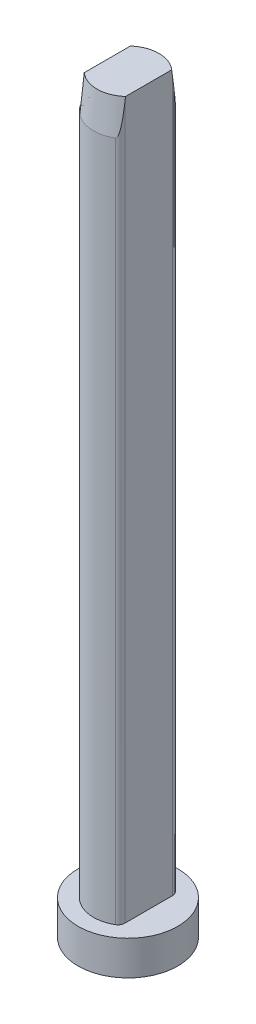
ISO-10303-21;
HEADER;
FILE_DESCRIPTION(('STEP AP214'),'2;1');
FILE_NAME('part.step','',(''),(''),'','','');
FILE_SCHEMA(('AUTOMOTIVE_DESIGN { 1 0 10303 214 1 1 1 1 }'));
ENDSEC;
DATA;
#1=APPLICATION_CONTEXT('core data for automotive mechanical design processes');
#2=APPLICATION_PROTOCOL_DEFINITION('international standard','automotive_design',2000,#1);
#3=PRODUCT_CONTEXT('',#1,'mechanical');
#4=PRODUCT('Part','Part','',(#3));
#5=PRODUCT_RELATED_PRODUCT_CATEGORY('part','',(#4));
#6=PRODUCT_DEFINITION_FORMATION('','',#4);
#7=PRODUCT_DEFINITION_CONTEXT('part definition',#1,'design');
#8=PRODUCT_DEFINITION('design','',#6,#7);
#9=PRODUCT_DEFINITION_SHAPE('','',#8);
#10=(LENGTH_UNIT() NAMED_UNIT(*) SI_UNIT(.MILLI.,.METRE.));
#11=(NAMED_UNIT(*) PLANE_ANGLE_UNIT() SI_UNIT($,.RADIAN.));
#12=(NAMED_UNIT(*) SI_UNIT($,.STERADIAN.) SOLID_ANGLE_UNIT());
#13=UNCERTAINTY_MEASURE_WITH_UNIT(LENGTH_MEASURE(1.E-05),#10,'distance_accuracy_value','');
#14=(GEOMETRIC_REPRESENTATION_CONTEXT(3) GLOBAL_UNCERTAINTY_ASSIGNED_CONTEXT((#13)) GLOBAL_UNIT_ASSIGNED_CONTEXT((#10,
#11,#12)) REPRESENTATION_CONTEXT('',''));
#15=CARTESIAN_POINT('',(0.,0.,0.));
#16=DIRECTION('',(0.,0.,1.));
#17=DIRECTION('',(1.,0.,0.));
#18=AXIS2_PLACEMENT_3D('',#15,#16,#17);
#19=CARTESIAN_POINT('',(0.,104.,0.));
#20=DIRECTION('',(0.,-1.,0.));
#21=DIRECTION('',(1.,0.,0.));
#22=AXIS2_PLACEMENT_3D('',#19,#20,#21);
#23=CONICAL_SURFACE('',#22,5.,0.0996686524911619);
#24=CARTESIAN_POINT('',(2.99999999999998,118.434181132057,-1.91030749291144));
#25=CARTESIAN_POINT('',(2.99999999999998,118.169026722365,-1.95964824651908));
#26=CARTESIAN_POINT('',(2.99999999999998,117.903640455359,-2.007722613411));
#27=CARTESIAN_POINT('',(2.99999999999998,117.372493997082,-2.10173065932007));
#28=CARTESIAN_POINT('',(2.99999999999998,117.106733813434,-2.14766438134868));
#29=CARTESIAN_POINT('',(2.99999999999998,116.574937472328,-2.23778198474897));
#30=CARTESIAN_POINT('',(2.99999999999998,116.308901335741,-2.28196598978298));
#31=CARTESIAN_POINT('',(2.99999999999998,115.776586401695,-2.36885455334264));
#32=CARTESIAN_POINT('',(2.99999999999998,115.510307602819,-2.41155910316994));
#33=CARTESIAN_POINT('',(2.99999999999998,114.711261223612,-2.53777614056674));
#34=CARTESIAN_POINT('',(2.99999999999998,114.178196280023,-2.61940666389815));
#35=CARTESIAN_POINT('',(2.99999999999998,113.111492497118,-2.77888411894668));
#36=CARTESIAN_POINT('',(2.99999999999998,112.577853645363,-2.85673096690284));
#37=CARTESIAN_POINT('',(2.99999999999998,111.317552777612,-3.03701346260882));
#38=CARTESIAN_POINT('',(2.99999999999998,110.590710562612,-3.13818769009922));
#39=CARTESIAN_POINT('',(2.99999999999998,109.136467752285,-3.3364482455146));
#40=CARTESIAN_POINT('',(2.99999999999998,108.409067153915,-3.43353455099871));
#41=CARTESIAN_POINT('',(2.99999999999998,106.953838062382,-3.62453269858025));
#42=CARTESIAN_POINT('',(2.99999999999998,106.226009562409,-3.71844448867911));
#43=CARTESIAN_POINT('',(2.99999999999998,104.770030548451,-3.90373907929056));
#44=CARTESIAN_POINT('',(2.99999999999998,104.041880034088,-3.99512187682653));
#45=CARTESIAN_POINT('',(2.99999999999998,102.584994612801,-4.17586982906224));
#46=CARTESIAN_POINT('',(2.99999999999998,101.856259590516,-4.26523405256175));
#47=CARTESIAN_POINT('',(2.99999999999998,100.398581804922,-4.44225615326758));
#48=CARTESIAN_POINT('',(2.99999999999998,99.6696390414014,-4.5299140287213));
#49=CARTESIAN_POINT('',(2.99999999999998,98.2116308279777,-4.70379309546534));
#50=CARTESIAN_POINT('',(2.99999999999999,97.4825653892439,-4.79001438052033));
#51=CARTESIAN_POINT('',(2.99999999999999,96.0242924886217,-4.96123148537374));
#52=CARTESIAN_POINT('',(2.99999999999999,95.2950850271068,-5.04622730835174));
#53=CARTESIAN_POINT('',(2.99999999999999,94.5658188679434,-5.13071329040915));
#54=B_SPLINE_CURVE_WITH_KNOTS('',3,(#24,#25,#26,#27,#28,#29,#30,#31,#32,#33,#34,#35,#36,#37,#38,
#39,#40,#41,#42,#43,#44,#45,#46,#47,#48,#49,#50,#51,#52,#53),.UNSPECIFIED.,.F.,.F.,(4,2,2,2,2,2,
2,2,2,2,2,2,2,2,4),(0.,0.809109774099037,1.61820328393684,2.42723950816652,3.23628048825017,
4.85409666078207,6.47194863134846,8.67348154165934,10.8750265358256,13.0766075738498,
15.2781912030261,17.4807705306104,19.6833521203434,21.885789382345,24.0882209288846),.UNSPECIFIED.);
#55=CARTESIAN_POINT('',(2.99999999999998,109.,-3.35410196624968));
#56=VERTEX_POINT('',#55);
#57=CARTESIAN_POINT('',(2.99999999999998,108.174243050442,-3.46410161513768));
#58=VERTEX_POINT('',#57);
#59=EDGE_CURVE('E193',#56,#58,#54,.T.);
#60=ORIENTED_EDGE('',*,*,#59,.T.);
#61=CARTESIAN_POINT('',(2.99999999999998,108.174243050442,-3.46410161513776));
#62=CARTESIAN_POINT('',(2.99998599104499,108.012493339984,-3.48550713091501));
#63=CARTESIAN_POINT('',(2.99931191831593,107.850804278668,-3.50739909583709));
#64=CARTESIAN_POINT('',(2.99635756349835,107.527352902679,-3.55234630747994));
#65=CARTESIAN_POINT('',(2.9940748431618,107.365590849801,-3.57540327069353));
#66=CARTESIAN_POINT('',(2.98747856805227,107.035440885158,-3.6238111235825));
#67=CARTESIAN_POINT('',(2.98308305754032,106.867062661715,-3.6492178160158));
#68=CARTESIAN_POINT('',(2.97174118783767,106.530885607621,-3.70166989379034));
#69=CARTESIAN_POINT('',(2.96479838823913,106.363086296702,-3.72871294864546));
#70=CARTESIAN_POINT('',(2.94763454025177,106.028386742594,-3.78481093233961));
#71=CARTESIAN_POINT('',(2.93742127329234,105.861485311985,-3.81386095859935));
#72=CARTESIAN_POINT('',(2.91861947778864,105.611422950714,-3.85958598196622));
#73=CARTESIAN_POINT('',(2.91175386057918,105.527942788427,-3.87522096426867));
#74=CARTESIAN_POINT('',(2.89658176321895,105.361309326476,-3.90733715169268));
#75=CARTESIAN_POINT('',(2.88827586356467,105.278155908876,-3.92381801401095));
#76=CARTESIAN_POINT('',(2.87004594097125,105.11424977381,-3.95743536277622));
#77=CARTESIAN_POINT('',(2.86016539362901,105.033487223072,-3.97454672419335));
#78=CARTESIAN_POINT('',(2.83803184188019,104.872456976771,-4.01012522260214));
#79=CARTESIAN_POINT('',(2.82577533300259,104.79219019516,-4.02859433694662));
#80=CARTESIAN_POINT('',(2.79798230475039,104.63320836518,-4.06726079706488));
#81=CARTESIAN_POINT('',(2.78246943529547,104.554486376734,-4.08744508883495));
#82=CARTESIAN_POINT('',(2.75505122411401,104.438086872539,-4.11991556878495));
#83=CARTESIAN_POINT('',(2.74523444828661,104.399612321373,-4.13109016611999));
#84=CARTESIAN_POINT('',(2.72365413794977,104.323534868891,-4.15445101476874));
#85=CARTESIAN_POINT('',(2.71189242167946,104.285931190517,-4.16663631596657));
#86=CARTESIAN_POINT('',(2.69207522538486,104.230878537202,-4.18598434492549));
#87=CARTESIAN_POINT('',(2.6851420113453,104.212829071738,-4.19258092085938));
#88=CARTESIAN_POINT('',(2.67026030761669,104.177187867312,-4.20629717453033));
#89=CARTESIAN_POINT('',(2.66230546802423,104.159599898799,-4.21341999429921));
#90=CARTESIAN_POINT('',(2.64289177968505,104.120930147718,-4.23019408670434));
#91=CARTESIAN_POINT('',(2.63105804743905,104.10011436727,-4.24002425763985));
#92=CARTESIAN_POINT('',(2.60423891702461,104.061397979164,-4.26108754115445));
#93=CARTESIAN_POINT('',(2.58928857619582,104.043468577104,-4.27230452643414));
#94=CARTESIAN_POINT('',(2.56613622052159,104.024259541073,-4.28844250322745));
#95=CARTESIAN_POINT('',(2.5600653494239,104.01984067969,-4.29258506355391));
#96=CARTESIAN_POINT('',(2.54737098935209,104.012132006825,-4.30102645314313));
#97=CARTESIAN_POINT('',(2.54075006331238,104.008837288106,-4.30532451020638));
#98=CARTESIAN_POINT('',(2.52850174776775,104.004255018306,-4.31305738786029));
#99=CARTESIAN_POINT('',(2.52297118475827,104.002686857556,-4.31647679237044));
#100=CARTESIAN_POINT('',(2.51164572292978,104.000546431136,-4.32332448703556));
#101=CARTESIAN_POINT('',(2.50584862911969,103.999984999615,-4.32675248087086));
#102=CARTESIAN_POINT('',(2.49999999999999,104.,-4.33012701892219));
#103=B_SPLINE_CURVE_WITH_KNOTS('',3,(#61,#62,#63,#64,#65,#66,#67,#68,#69,#70,#71,#72,#73,#74,
#75,#76,#77,#78,#79,#80,#81,#82,#83,#84,#85,#86,#87,#88,#89,#90,#91,#92,#93,#94,#95,#96,#97,#98,
#99,#100,#101,#102),.UNSPECIFIED.,.F.,.F.,(4,2,2,2,2,2,2,2,2,2,2,2,2,2,2,2,2,2,2,2,4),(0.,
0.489483145654107,0.97970980746598,1.4907093104966,2.00099744364702,2.5100803576668,
2.7656935891079,3.02120403573983,3.27060042470856,3.52036750377902,3.76837975354925,
3.89209234141537,4.01568992297308,4.07695574399941,4.13862267722859,4.21616293661914,
4.29287397821414,4.31852918738845,4.34407092604696,4.36406127155424,4.38426548528841),.UNSPECIFIED.);
#104=CARTESIAN_POINT('',(2.49999999999998,104.,-4.33012701892219));
#105=VERTEX_POINT('',#104);
#106=EDGE_CURVE('E54',#58,#105,#103,.T.);
#107=ORIENTED_EDGE('',*,*,#106,.T.);
#108=CARTESIAN_POINT('',(0.,104.,0.));
#109=DIRECTION('',(0.,1.,0.));
#110=DIRECTION('',(-1.,0.,0.));
#111=AXIS2_PLACEMENT_3D('',#108,#109,#110);
#112=CIRCLE('',#111,5.);
#113=CARTESIAN_POINT('',(-3.00000000000002,104.,-4.));
#114=VERTEX_POINT('',#113);
#115=EDGE_CURVE('E133',#105,#114,#112,.T.);
#116=ORIENTED_EDGE('',*,*,#115,.T.);
#117=CARTESIAN_POINT('',(-3.00000000000001,94.5658188679434,-5.13071329040915));
#118=CARTESIAN_POINT('',(-3.00000000000001,95.4608438765833,-5.02701449167616));
#119=CARTESIAN_POINT('',(-3.00000000000002,96.3557824478392,-4.9225613660625));
#120=CARTESIAN_POINT('',(-3.00000000000002,98.1454195872636,-4.71174044533623));
#121=CARTESIAN_POINT('',(-3.00000000000002,99.0401181589939,-4.60537268044025));
#122=CARTESIAN_POINT('',(-3.00000000000002,100.829101944544,-4.39032938297296));
#123=CARTESIAN_POINT('',(-3.00000000000002,101.723387200281,-4.28165419967055));
#124=CARTESIAN_POINT('',(-3.00000000000002,103.511616490279,-4.06139348479664));
#125=CARTESIAN_POINT('',(-3.00000000000002,104.405560518174,-3.94980790139147));
#126=CARTESIAN_POINT('',(-3.00000000000002,105.848005668343,-3.76669334469978));
#127=CARTESIAN_POINT('',(-3.00000000000002,106.396654510425,-3.69632821282581));
#128=CARTESIAN_POINT('',(-3.00000000000002,107.493734545364,-3.55392617733465));
#129=CARTESIAN_POINT('',(-3.00000000000002,108.042165738612,-3.48188927673615));
#130=CARTESIAN_POINT('',(-3.00000000000002,109.138737808519,-3.33581435462646));
#131=CARTESIAN_POINT('',(-3.00000000000002,109.686878696725,-3.26177641994249));
#132=CARTESIAN_POINT('',(-3.00000000000002,110.782829461921,-3.11125424881249));
#133=CARTESIAN_POINT('',(-3.00000000000002,111.330639336455,-3.03476999445121));
#134=CARTESIAN_POINT('',(-3.00000000000002,112.425942811904,-2.87873442695696));
#135=CARTESIAN_POINT('',(-3.00000000000002,112.9734363199,-2.79918246015692));
#136=CARTESIAN_POINT('',(-3.00000000000002,114.067835105669,-2.63617928707474));
#137=CARTESIAN_POINT('',(-3.00000000000002,114.614740395192,-2.55272816021355));
#138=CARTESIAN_POINT('',(-3.00000000000002,115.434526213374,-2.4236448842179));
#139=CARTESIAN_POINT('',(-3.00000000000002,115.707713809233,-2.37996251465587));
#140=CARTESIAN_POINT('',(-3.00000000000002,116.253837498489,-2.29106058524646));
#141=CARTESIAN_POINT('',(-3.00000000000002,116.526773593419,-2.2458410348308));
#142=CARTESIAN_POINT('',(-3.00000000000002,117.072357669743,-2.15357855065603));
#143=CARTESIAN_POINT('',(-3.00000000000002,117.345005630439,-2.10653549398405));
#144=CARTESIAN_POINT('',(-3.00000000000002,117.889910587855,-2.01020765763438));
#145=CARTESIAN_POINT('',(-3.00000000000002,118.162167576209,-1.9609228307138));
#146=CARTESIAN_POINT('',(-3.00000000000002,118.434181132057,-1.91030749291144));
#147=B_SPLINE_CURVE_WITH_KNOTS('',3,(#117,#118,#119,#120,#121,#122,#123,#124,#125,#126,#127,
#128,#129,#130,#131,#132,#133,#134,#135,#136,#137,#138,#139,#140,#141,#142,#143,#144,#145,#146),
.UNSPECIFIED.,.F.,.F.,(4,2,2,2,2,2,2,2,2,2,2,2,2,2,4),(0.,2.70303809862696,5.40603357551646,
8.10862278229031,10.811260154572,12.4706861081344,14.1301090655163,15.7894601338176,
17.4488233569058,19.1085421316947,20.7682271148419,21.5981974057535,22.4281626051062,
23.2581838456215,24.0882225860509),.UNSPECIFIED.);
#148=CARTESIAN_POINT('',(-3.00000000000002,109.,-3.35410196624968));
#149=VERTEX_POINT('',#148);
#150=EDGE_CURVE('E116',#114,#149,#147,.T.);
#151=ORIENTED_EDGE('',*,*,#150,.T.);
#152=CARTESIAN_POINT('',(0.,109.,0.));
#153=DIRECTION('',(0.,1.,0.));
#154=DIRECTION('',(-1.,0.,0.));
#155=AXIS2_PLACEMENT_3D('',#152,#153,#154);
#156=CIRCLE('',#155,4.5);
#157=EDGE_CURVE('E199',#56,#149,#156,.T.);
#158=ORIENTED_EDGE('',*,*,#157,.F.);
#159=EDGE_LOOP('',(#60,#107,#116,#151,#158));
#160=FACE_BOUND('',#159,.T.);
#161=ADVANCED_FACE('F38',(#160),#23,.T.);
#162=CARTESIAN_POINT('',(0.,0.,0.));
#163=DIRECTION('',(0.,1.,0.));
#164=DIRECTION('',(-1.,0.,0.));
#165=AXIS2_PLACEMENT_3D('',#162,#163,#164);
#166=PLANE('',#165);
#167=CARTESIAN_POINT('',(0.,0.,0.));
#168=DIRECTION('',(0.,1.,0.));
#169=DIRECTION('',(-1.,0.,0.));
#170=AXIS2_PLACEMENT_3D('',#167,#168,#169);
#171=CIRCLE('',#170,7.25);
#172=CARTESIAN_POINT('',(-7.25,0.,0.));
#173=VERTEX_POINT('',#172);
#174=EDGE_CURVE('E142',#173,#173,#171,.T.);
#175=ORIENTED_EDGE('',*,*,#174,.F.);
#176=EDGE_LOOP('',(#175));
#177=FACE_BOUND('',#176,.T.);
#178=ADVANCED_FACE('F214',(#177),#166,.F.);
#179=CARTESIAN_POINT('',(0.,109.,0.));
#180=DIRECTION('',(0.,1.,0.));
#181=DIRECTION('',(-1.,0.,0.));
#182=AXIS2_PLACEMENT_3D('',#179,#180,#181);
#183=CYLINDRICAL_SURFACE('',#182,7.25);
#184=CARTESIAN_POINT('',(0.,5.,0.));
#185=DIRECTION('',(0.,1.,0.));
#186=DIRECTION('',(-1.,0.,0.));
#187=AXIS2_PLACEMENT_3D('',#184,#185,#186);
#188=CIRCLE('',#187,7.25);
#189=CARTESIAN_POINT('',(-7.25,5.,0.));
#190=VERTEX_POINT('',#189);
#191=EDGE_CURVE('E135',#190,#190,#188,.T.);
#192=ORIENTED_EDGE('',*,*,#191,.F.);
#193=EDGE_LOOP('',(#192));
#194=FACE_BOUND('',#193,.T.);
#195=ORIENTED_EDGE('',*,*,#174,.T.);
#196=EDGE_LOOP('',(#195));
#197=FACE_BOUND('',#196,.T.);
#198=ADVANCED_FACE('F219',(#194,#197),#183,.T.);
#199=CARTESIAN_POINT('',(7.25,5.,0.));
#200=DIRECTION('',(0.,-1.,0.));
#201=DIRECTION('',(1.,0.,0.));
#202=AXIS2_PLACEMENT_3D('',#199,#200,#201);
#203=PLANE('',#202);
#204=CARTESIAN_POINT('',(0.,5.,0.));
#205=DIRECTION('',(0.,1.,0.));
#206=DIRECTION('',(-1.,0.,0.));
#207=AXIS2_PLACEMENT_3D('',#204,#205,#206);
#208=CIRCLE('',#207,5.);
#209=CARTESIAN_POINT('',(2.49999999999999,5.,-4.3301270189222));
#210=VERTEX_POINT('',#209);
#211=CARTESIAN_POINT('',(2.49999999999999,5.,4.3301270189222));
#212=VERTEX_POINT('',#211);
#213=EDGE_CURVE('E132',#210,#212,#208,.T.);
#214=ORIENTED_EDGE('',*,*,#213,.F.);
#215=CARTESIAN_POINT('',(2.,5.,-3.46410161513776));
#216=DIRECTION('',(0.,-1.,0.));
#217=DIRECTION('',(1.,0.,0.));
#218=AXIS2_PLACEMENT_3D('',#215,#216,#217);
#219=CIRCLE('',#218,1.);
#220=CARTESIAN_POINT('',(3.,5.,-3.46410161513776));
#221=VERTEX_POINT('',#220);
#222=EDGE_CURVE('E11',#210,#221,#219,.T.);
#223=ORIENTED_EDGE('',*,*,#222,.T.);
#224=DIRECTION('',(0.,0.,1.));
#225=VECTOR('',#224,1.);
#226=CARTESIAN_POINT('',(3.,5.,4.));
#227=LINE('',#226,#225);
#228=CARTESIAN_POINT('',(3.,5.,3.46410161513776));
#229=VERTEX_POINT('',#228);
#230=EDGE_CURVE('E107',#221,#229,#227,.T.);
#231=ORIENTED_EDGE('',*,*,#230,.T.);
#232=CARTESIAN_POINT('',(2.,5.,3.46410161513776));
#233=DIRECTION('',(0.,-1.,0.));
#234=DIRECTION('',(1.,0.,0.));
#235=AXIS2_PLACEMENT_3D('',#232,#233,#234);
#236=CIRCLE('',#235,1.);
#237=EDGE_CURVE('E47',#229,#212,#236,.T.);
#238=ORIENTED_EDGE('',*,*,#237,.T.);
#239=EDGE_LOOP('',(#214,#223,#231,#238));
#240=FACE_BOUND('',#239,.T.);
#241=ORIENTED_EDGE('',*,*,#191,.T.);
#242=EDGE_LOOP('',(#241));
#243=FACE_BOUND('',#242,.T.);
#244=ADVANCED_FACE('F227',(#240,#243),#203,.F.);
#245=CARTESIAN_POINT('',(0.,109.,0.));
#246=DIRECTION('',(0.,1.,0.));
#247=DIRECTION('',(-1.,0.,0.));
#248=AXIS2_PLACEMENT_3D('',#245,#246,#247);
#249=CYLINDRICAL_SURFACE('',#248,5.);
#250=ORIENTED_EDGE('',*,*,#213,.T.);
#251=DIRECTION('',(0.,1.,0.));
#252=VECTOR('',#251,1.);
#253=CARTESIAN_POINT('',(2.49999999999998,109.,4.33012701892219));
#254=LINE('',#253,#252);
#255=CARTESIAN_POINT('',(2.49999999999998,104.,4.33012701892219));
#256=VERTEX_POINT('',#255);
#257=EDGE_CURVE('E131',#212,#256,#254,.T.);
#258=ORIENTED_EDGE('',*,*,#257,.T.);
#259=CARTESIAN_POINT('',(-3.00000000000002,104.,4.));
#260=VERTEX_POINT('',#259);
#261=EDGE_CURVE('E122',#260,#256,#112,.T.);
#262=ORIENTED_EDGE('',*,*,#261,.F.);
#263=CARTESIAN_POINT('',(0.,104.,0.));
#264=DIRECTION('',(0.,1.,0.));
#265=DIRECTION('',(-1.,0.,0.));
#266=AXIS2_PLACEMENT_3D('',#263,#264,#265);
#267=CIRCLE('',#266,5.);
#268=EDGE_CURVE('E100',#114,#260,#267,.T.);
#269=ORIENTED_EDGE('',*,*,#268,.F.);
#270=ORIENTED_EDGE('',*,*,#115,.F.);
#271=DIRECTION('',(0.,1.,0.));
#272=VECTOR('',#271,1.);
#273=CARTESIAN_POINT('',(2.49999999999998,109.,-4.33012701892219));
#274=LINE('',#273,#272);
#275=EDGE_CURVE('E150',#105,#210,#274,.F.);
#276=ORIENTED_EDGE('',*,*,#275,.T.);
#277=EDGE_LOOP('',(#250,#258,#262,#269,#270,#276));
#278=FACE_BOUND('',#277,.T.);
#279=ADVANCED_FACE('F129',(#278),#249,.T.);
#280=ORIENTED_EDGE('',*,*,#261,.T.);
#281=CARTESIAN_POINT('',(2.49999999999998,104.,4.33012701892219));
#282=CARTESIAN_POINT('',(2.5069994601099,103.999973343842,4.32608973409515));
#283=CARTESIAN_POINT('',(2.51391267677625,104.00078231559,4.32198161319017));
#284=CARTESIAN_POINT('',(2.52731013344842,104.003813198382,4.31380913403737));
#285=CARTESIAN_POINT('',(2.53379922412655,104.006013917451,4.30974503356069));
#286=CARTESIAN_POINT('',(2.5481253058275,104.012391873588,4.30055345206842));
#287=CARTESIAN_POINT('',(2.55580663871825,104.016957456622,4.29545981901116));
#288=CARTESIAN_POINT('',(2.57039364626571,104.027473996779,4.2855207471528));
#289=CARTESIAN_POINT('',(2.57729386407812,104.033433902877,4.28067716935584));
#290=CARTESIAN_POINT('',(2.59585995007378,104.051671575673,4.26732775740162));
#291=CARTESIAN_POINT('',(2.60666544246622,104.065053887311,4.25915980102927));
#292=CARTESIAN_POINT('',(2.62652010704587,104.093426576535,4.24360793835824));
#293=CARTESIAN_POINT('',(2.63556540183845,104.108420393755,4.23622577886287));
#294=CARTESIAN_POINT('',(2.65843509133516,104.150395903535,4.21697833849811));
#295=CARTESIAN_POINT('',(2.67105292490888,104.178284365614,4.20568115088652));
#296=CARTESIAN_POINT('',(2.69405738846049,104.235395976862,4.18419023841222));
#297=CARTESIAN_POINT('',(2.70443806130505,104.264622444282,4.17399949470483));
#298=CARTESIAN_POINT('',(2.72369517231374,104.324015110288,4.15435925343034));
#299=CARTESIAN_POINT('',(2.73256241099445,104.354185822422,4.14491446444104));
#300=CARTESIAN_POINT('',(2.74912225107479,104.414976734414,4.1266467102773));
#301=CARTESIAN_POINT('',(2.7568164313451,104.445596268198,4.11782291804971));
#302=CARTESIAN_POINT('',(2.78130760392573,104.54951648194,4.0888262755365));
#303=CARTESIAN_POINT('',(2.79606888546025,104.623595538418,4.06973659631436));
#304=CARTESIAN_POINT('',(2.82255798977728,104.772710670099,4.03322066109368));
#305=CARTESIAN_POINT('',(2.83428377030569,104.847747354153,4.015795529934));
#306=CARTESIAN_POINT('',(2.85560054516278,104.998553940659,3.98212308530683));
#307=CARTESIAN_POINT('',(2.86518694922982,105.074325062533,3.9658783538983));
#308=CARTESIAN_POINT('',(2.88273046262041,105.226252442419,3.9343252507025));
#309=CARTESIAN_POINT('',(2.89068739644675,105.302408741012,3.91901697989828));
#310=CARTESIAN_POINT('',(2.91263779390489,105.531198493462,3.87423155465516));
#311=CARTESIAN_POINT('',(2.92472143218894,105.684234006778,3.84587617423549));
#312=CARTESIAN_POINT('',(2.94538842216376,105.990716950265,3.79133280904113));
#313=CARTESIAN_POINT('',(2.95397594369287,106.144163668704,3.76514227214935));
#314=CARTESIAN_POINT('',(2.96864766904853,106.454141589074,3.71398623914671));
#315=CARTESIAN_POINT('',(2.97468545967828,106.61067979661,3.68905018316631));
#316=CARTESIAN_POINT('',(2.98461401293532,106.924107073127,3.6405824618942));
#317=CARTESIAN_POINT('',(2.98850384912634,107.080996264245,3.617051406491));
#318=CARTESIAN_POINT('',(2.99449788918929,107.393898625228,3.57135196762544));
#319=CARTESIAN_POINT('',(2.99661423534307,107.54991036522,3.54917529807688));
#320=CARTESIAN_POINT('',(2.99935872753469,107.862010290718,3.50588193783299));
#321=CARTESIAN_POINT('',(2.99998766092929,108.018098392014,3.48476469213269));
#322=CARTESIAN_POINT('',(2.99999999999998,108.174243050442,3.46410161513776));
#323=B_SPLINE_CURVE_WITH_KNOTS('',3,(#281,#282,#283,#284,#285,#286,#287,#288,#289,#290,#291,
#292,#293,#294,#295,#296,#297,#298,#299,#300,#301,#302,#303,#304,#305,#306,#307,#308,#309,#310,
#311,#312,#313,#314,#315,#316,#317,#318,#319,#320,#321,#322),.UNSPECIFIED.,.F.,.F.,(4,2,2,2,2,2,
2,2,2,2,2,2,2,2,2,2,2,2,2,2,4),(0.,0.0241370305694575,0.0479150982805201,0.0785968370501978,
0.109481176781033,0.166284494371477,0.223211557034664,0.320837537591244,0.418720350601585,
0.517178454418198,0.615502846490343,0.849066226964191,1.08278634048654,1.31700320465256,
1.55124528119269,2.01947834313562,2.48715129309868,2.96300438448342,3.43906255652912,
3.91183410921268,4.38435534584968),.UNSPECIFIED.);
#324=CARTESIAN_POINT('',(2.99999999999998,108.174243050442,3.46410161513838));
#325=VERTEX_POINT('',#324);
#326=EDGE_CURVE('E153',#256,#325,#323,.T.);
#327=ORIENTED_EDGE('',*,*,#326,.T.);
#328=CARTESIAN_POINT('',(2.99999999999999,94.5658188679434,5.13071329040915));
#329=CARTESIAN_POINT('',(2.99999999999999,95.4608438765833,5.02701449167616));
#330=CARTESIAN_POINT('',(2.99999999999998,96.3557824478392,4.9225613660625));
#331=CARTESIAN_POINT('',(2.99999999999998,98.1454195872636,4.71174044533623));
#332=CARTESIAN_POINT('',(2.99999999999998,99.0401181589939,4.60537268044025));
#333=CARTESIAN_POINT('',(2.99999999999998,100.829101944544,4.39032938297296));
#334=CARTESIAN_POINT('',(2.99999999999998,101.723387200281,4.28165419967055));
#335=CARTESIAN_POINT('',(2.99999999999998,103.511616490279,4.06139348479664));
#336=CARTESIAN_POINT('',(2.99999999999998,104.405560518174,3.94980790139147));
#337=CARTESIAN_POINT('',(2.99999999999998,105.848005668343,3.76669334469978));
#338=CARTESIAN_POINT('',(2.99999999999998,106.396654510425,3.69632821282581));
#339=CARTESIAN_POINT('',(2.99999999999998,107.493734545364,3.55392617733464));
#340=CARTESIAN_POINT('',(2.99999999999998,108.042165738612,3.48188927673615));
#341=CARTESIAN_POINT('',(2.99999999999998,109.138737808519,3.33581435462646));
#342=CARTESIAN_POINT('',(2.99999999999998,109.686878696725,3.26177641994249));
#343=CARTESIAN_POINT('',(2.99999999999998,110.782829461921,3.11125424881249));
#344=CARTESIAN_POINT('',(2.99999999999998,111.330639336455,3.03476999445121));
#345=CARTESIAN_POINT('',(2.99999999999998,112.425942811904,2.87873442695696));
#346=CARTESIAN_POINT('',(2.99999999999998,112.9734363199,2.79918246015692));
#347=CARTESIAN_POINT('',(2.99999999999998,114.067835105669,2.63617928707474));
#348=CARTESIAN_POINT('',(2.99999999999998,114.614740395192,2.55272816021354));
#349=CARTESIAN_POINT('',(2.99999999999998,115.434526213374,2.42364488421789));
#350=CARTESIAN_POINT('',(2.99999999999998,115.707713809233,2.37996251465587));
#351=CARTESIAN_POINT('',(2.99999999999998,116.253837498489,2.29106058524645));
#352=CARTESIAN_POINT('',(2.99999999999998,116.526773593419,2.2458410348308));
#353=CARTESIAN_POINT('',(2.99999999999998,117.072357669743,2.15357855065603));
#354=CARTESIAN_POINT('',(2.99999999999998,117.345005630439,2.10653549398404));
#355=CARTESIAN_POINT('',(2.99999999999998,117.889910587855,2.01020765763437));
#356=CARTESIAN_POINT('',(2.99999999999998,118.162167576209,1.96092283071379));
#357=CARTESIAN_POINT('',(2.99999999999998,118.434181132057,1.91030749291144));
#358=B_SPLINE_CURVE_WITH_KNOTS('',3,(#328,#329,#330,#331,#332,#333,#334,#335,#336,#337,#338,
#339,#340,#341,#342,#343,#344,#345,#346,#347,#348,#349,#350,#351,#352,#353,#354,#355,#356,#357),
.UNSPECIFIED.,.F.,.F.,(4,2,2,2,2,2,2,2,2,2,2,2,2,2,4),(0.,2.70303809862696,5.40603357551645,
8.10862278229031,10.811260154572,12.4706861081344,14.1301090655163,15.7894601338176,
17.4488233569058,19.1085421316947,20.7682271148419,21.5981974057535,22.4281626051063,
23.2581838456215,24.088222586051),.UNSPECIFIED.);
#359=CARTESIAN_POINT('',(2.99999999999998,109.,3.35410196624968));
#360=VERTEX_POINT('',#359);
#361=EDGE_CURVE('E125',#325,#360,#358,.T.);
#362=ORIENTED_EDGE('',*,*,#361,.T.);
#363=CARTESIAN_POINT('',(-3.00000000000002,109.,3.35410196624968));
#364=VERTEX_POINT('',#363);
#365=EDGE_CURVE('E124',#364,#360,#156,.T.);
#366=ORIENTED_EDGE('',*,*,#365,.F.);
#367=CARTESIAN_POINT('',(-3.00000000000002,118.434181132057,1.91030749291144));
#368=CARTESIAN_POINT('',(-3.00000000000002,118.169026722365,1.95964824651909));
#369=CARTESIAN_POINT('',(-3.00000000000002,117.903640455359,2.00772261341101));
#370=CARTESIAN_POINT('',(-3.00000000000002,117.372493997082,2.10173065932008));
#371=CARTESIAN_POINT('',(-3.00000000000002,117.106733813434,2.14766438134868));
#372=CARTESIAN_POINT('',(-3.00000000000002,116.574937472328,2.23778198474898));
#373=CARTESIAN_POINT('',(-3.00000000000002,116.308901335741,2.28196598978299));
#374=CARTESIAN_POINT('',(-3.00000000000002,115.776586401695,2.36885455334264));
#375=CARTESIAN_POINT('',(-3.00000000000002,115.510307602818,2.41155910316995));
#376=CARTESIAN_POINT('',(-3.00000000000002,114.711261223612,2.53777614056675));
#377=CARTESIAN_POINT('',(-3.00000000000002,114.178196280023,2.61940666389816));
#378=CARTESIAN_POINT('',(-3.00000000000002,113.111492497118,2.77888411894668));
#379=CARTESIAN_POINT('',(-3.00000000000002,112.577853645363,2.85673096690285));
#380=CARTESIAN_POINT('',(-3.00000000000002,111.317552777612,3.03701346260883));
#381=CARTESIAN_POINT('',(-3.00000000000002,110.590710562612,3.13818769009923));
#382=CARTESIAN_POINT('',(-3.00000000000002,109.136467752285,3.3364482455146));
#383=CARTESIAN_POINT('',(-3.00000000000002,108.409067153914,3.43353455099872));
#384=CARTESIAN_POINT('',(-3.00000000000002,106.953838062382,3.62453269858026));
#385=CARTESIAN_POINT('',(-3.00000000000002,106.226009562409,3.71844448867911));
#386=CARTESIAN_POINT('',(-3.00000000000002,104.770030548451,3.90373907929056));
#387=CARTESIAN_POINT('',(-3.00000000000002,104.041880034088,3.99512187682653));
#388=CARTESIAN_POINT('',(-3.00000000000002,102.584994612801,4.17586982906224));
#389=CARTESIAN_POINT('',(-3.00000000000002,101.856259590516,4.26523405256176));
#390=CARTESIAN_POINT('',(-3.00000000000002,100.398581804922,4.44225615326758));
#391=CARTESIAN_POINT('',(-3.00000000000002,99.6696390414014,4.52991402872131));
#392=CARTESIAN_POINT('',(-3.00000000000002,98.2116308279777,4.70379309546534));
#393=CARTESIAN_POINT('',(-3.00000000000001,97.4825653892439,4.79001438052033));
#394=CARTESIAN_POINT('',(-3.00000000000001,96.0242924886217,4.96123148537374));
#395=CARTESIAN_POINT('',(-3.00000000000001,95.2950850271068,5.04622730835175));
#396=CARTESIAN_POINT('',(-3.00000000000001,94.5658188679434,5.13071329040915));
#397=B_SPLINE_CURVE_WITH_KNOTS('',3,(#367,#368,#369,#370,#371,#372,#373,#374,#375,#376,#377,
#378,#379,#380,#381,#382,#383,#384,#385,#386,#387,#388,#389,#390,#391,#392,#393,#394,#395,#396),
.UNSPECIFIED.,.F.,.F.,(4,2,2,2,2,2,2,2,2,2,2,2,2,2,4),(0.,0.809109774099038,1.61820328393684,
2.42723950816653,3.23628048825018,4.8540966607821,6.47194863134848,8.67348154165935,
10.8750265358256,13.0766075738498,15.2781912030261,17.4807705306104,19.6833521203434,
21.885789382345,24.0882209288846),.UNSPECIFIED.);
#398=EDGE_CURVE('E113',#364,#260,#397,.T.);
#399=ORIENTED_EDGE('',*,*,#398,.T.);
#400=EDGE_LOOP('',(#280,#327,#362,#366,#399));
#401=FACE_BOUND('',#400,.T.);
#402=ADVANCED_FACE('F121',(#401),#23,.T.);
#403=CARTESIAN_POINT('',(4.49999999999998,109.,0.));
#404=DIRECTION('',(0.,-1.,0.));
#405=DIRECTION('',(1.,0.,0.));
#406=AXIS2_PLACEMENT_3D('',#403,#404,#405);
#407=PLANE('',#406);
#408=ORIENTED_EDGE('',*,*,#365,.T.);
#409=DIRECTION('',(0.,0.,-1.));
#410=VECTOR('',#409,1.);
#411=CARTESIAN_POINT('',(2.99999999999998,109.,0.));
#412=LINE('',#411,#410);
#413=EDGE_CURVE('E147',#360,#56,#412,.T.);
#414=ORIENTED_EDGE('',*,*,#413,.T.);
#415=ORIENTED_EDGE('',*,*,#157,.T.);
#416=DIRECTION('',(0.,0.,1.));
#417=VECTOR('',#416,1.);
#418=CARTESIAN_POINT('',(-3.00000000000002,109.,0.));
#419=LINE('',#418,#417);
#420=EDGE_CURVE('E145',#149,#364,#419,.T.);
#421=ORIENTED_EDGE('',*,*,#420,.T.);
#422=EDGE_LOOP('',(#408,#414,#415,#421));
#423=FACE_BOUND('',#422,.T.);
#424=ADVANCED_FACE('F169',(#423),#407,.F.);
#425=CARTESIAN_POINT('',(-3.00000000000002,104.,-4.));
#426=DIRECTION('',(1.,0.,0.));
#427=DIRECTION('',(0.,1.,0.));
#428=AXIS2_PLACEMENT_3D('',#425,#426,#427);
#429=PLANE('',#428);
#430=ORIENTED_EDGE('',*,*,#420,.F.);
#431=ORIENTED_EDGE('',*,*,#150,.F.);
#432=DIRECTION('',(0.,0.,-1.));
#433=VECTOR('',#432,1.);
#434=CARTESIAN_POINT('',(-3.00000000000002,104.,-4.));
#435=LINE('',#434,#433);
#436=EDGE_CURVE('E103',#260,#114,#435,.T.);
#437=ORIENTED_EDGE('',*,*,#436,.F.);
#438=ORIENTED_EDGE('',*,*,#398,.F.);
#439=EDGE_LOOP('',(#430,#431,#437,#438));
#440=FACE_BOUND('',#439,.T.);
#441=ADVANCED_FACE('F112',(#440),#429,.F.);
#442=CARTESIAN_POINT('',(0.,104.,0.));
#443=DIRECTION('',(0.,1.,0.));
#444=DIRECTION('',(-1.,0.,0.));
#445=AXIS2_PLACEMENT_3D('',#442,#443,#444);
#446=PLANE('',#445);
#447=ORIENTED_EDGE('',*,*,#268,.T.);
#448=ORIENTED_EDGE('',*,*,#436,.T.);
#449=EDGE_LOOP('',(#447,#448));
#450=FACE_BOUND('',#449,.T.);
#451=ADVANCED_FACE('F102',(#450),#446,.T.);
#452=CARTESIAN_POINT('',(2.99999999999998,104.,-4.));
#453=DIRECTION('',(-1.,0.,0.));
#454=DIRECTION('',(0.,-1.,0.));
#455=AXIS2_PLACEMENT_3D('',#452,#453,#454);
#456=PLANE('',#455);
#457=ORIENTED_EDGE('',*,*,#361,.F.);
#458=DIRECTION('',(0.,1.,0.));
#459=VECTOR('',#458,1.);
#460=CARTESIAN_POINT('',(2.99999999999998,104.,3.46410161513776));
#461=LINE('',#460,#459);
#462=EDGE_CURVE('E62',#325,#229,#461,.F.);
#463=ORIENTED_EDGE('',*,*,#462,.T.);
#464=ORIENTED_EDGE('',*,*,#230,.F.);
#465=DIRECTION('',(0.,1.,0.));
#466=VECTOR('',#465,1.);
#467=CARTESIAN_POINT('',(2.99999999999998,104.,-3.46410161513776));
#468=LINE('',#467,#466);
#469=EDGE_CURVE('E160',#221,#58,#468,.T.);
#470=ORIENTED_EDGE('',*,*,#469,.T.);
#471=ORIENTED_EDGE('',*,*,#59,.F.);
#472=ORIENTED_EDGE('',*,*,#413,.F.);
#473=EDGE_LOOP('',(#457,#463,#464,#470,#471,#472));
#474=FACE_BOUND('',#473,.T.);
#475=ADVANCED_FACE('F200',(#474),#456,.F.);
#476=CARTESIAN_POINT('',(1.99999999999998,109.,3.46410161513776));
#477=DIRECTION('',(0.,1.,0.));
#478=DIRECTION('',(-1.,0.,0.));
#479=AXIS2_PLACEMENT_3D('',#476,#477,#478);
#480=CYLINDRICAL_SURFACE('',#479,1.);
#481=ORIENTED_EDGE('',*,*,#237,.F.);
#482=ORIENTED_EDGE('',*,*,#462,.F.);
#483=ORIENTED_EDGE('',*,*,#326,.F.);
#484=ORIENTED_EDGE('',*,*,#257,.F.);
#485=EDGE_LOOP('',(#481,#482,#483,#484));
#486=FACE_BOUND('',#485,.T.);
#487=ADVANCED_FACE('F162',(#486),#480,.T.);
#488=CARTESIAN_POINT('',(1.99999999999998,109.,-3.46410161513776));
#489=DIRECTION('',(0.,1.,0.));
#490=DIRECTION('',(-1.,0.,0.));
#491=AXIS2_PLACEMENT_3D('',#488,#489,#490);
#492=CYLINDRICAL_SURFACE('',#491,1.);
#493=ORIENTED_EDGE('',*,*,#222,.F.);
#494=ORIENTED_EDGE('',*,*,#275,.F.);
#495=ORIENTED_EDGE('',*,*,#106,.F.);
#496=ORIENTED_EDGE('',*,*,#469,.F.);
#497=EDGE_LOOP('',(#493,#494,#495,#496));
#498=FACE_BOUND('',#497,.T.);
#499=ADVANCED_FACE('F40',(#498),#492,.T.);
#500=CLOSED_SHELL('',(#161,#178,#198,#244,#279,#402,#424,#441,#451,#475,#487,#499));
#501=MANIFOLD_SOLID_BREP('B2',#500);
#502=ADVANCED_BREP_SHAPE_REPRESENTATION('',(#18,#501),#14);
#503=SHAPE_DEFINITION_REPRESENTATION(#9,#502);
ENDSEC;
END-ISO-10303-21;
